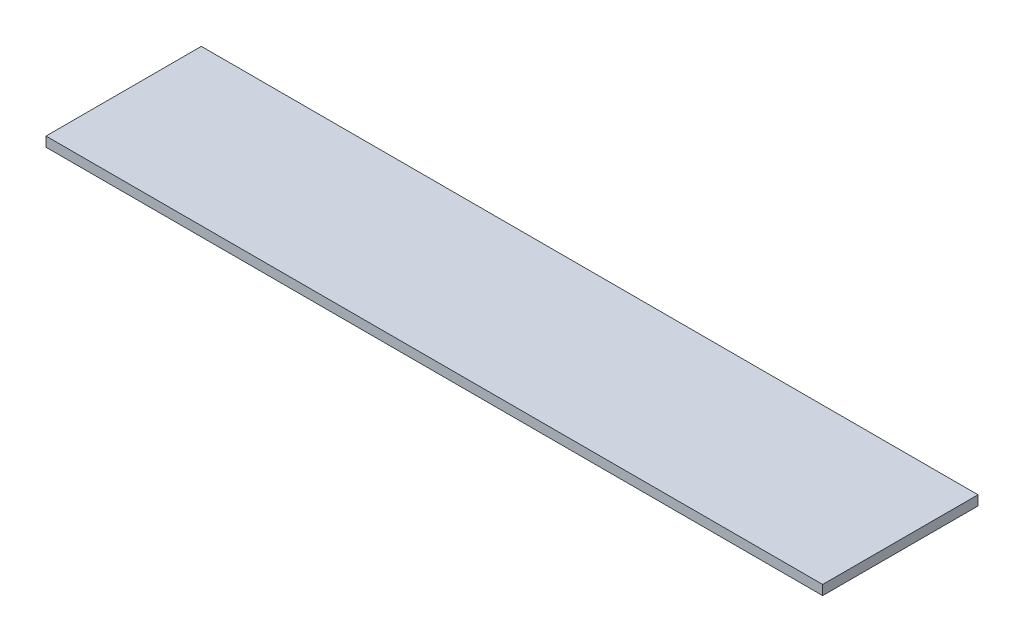
ISO-10303-21;
HEADER;
FILE_DESCRIPTION(('STEP AP214'),'2;1');
FILE_NAME('part.step','',(''),(''),'','','');
FILE_SCHEMA(('AUTOMOTIVE_DESIGN { 1 0 10303 214 1 1 1 1 }'));
ENDSEC;
DATA;
#1=APPLICATION_CONTEXT('core data for automotive mechanical design processes');
#2=APPLICATION_PROTOCOL_DEFINITION('international standard','automotive_design',2000,#1);
#3=PRODUCT_CONTEXT('',#1,'mechanical');
#4=PRODUCT('Part','Part','',(#3));
#5=PRODUCT_RELATED_PRODUCT_CATEGORY('part','',(#4));
#6=PRODUCT_DEFINITION_FORMATION('','',#4);
#7=PRODUCT_DEFINITION_CONTEXT('part definition',#1,'design');
#8=PRODUCT_DEFINITION('design','',#6,#7);
#9=PRODUCT_DEFINITION_SHAPE('','',#8);
#10=(LENGTH_UNIT() NAMED_UNIT(*) SI_UNIT(.MILLI.,.METRE.));
#11=(NAMED_UNIT(*) PLANE_ANGLE_UNIT() SI_UNIT($,.RADIAN.));
#12=(NAMED_UNIT(*) SI_UNIT($,.STERADIAN.) SOLID_ANGLE_UNIT());
#13=UNCERTAINTY_MEASURE_WITH_UNIT(LENGTH_MEASURE(1.E-05),#10,'distance_accuracy_value','');
#14=(GEOMETRIC_REPRESENTATION_CONTEXT(3) GLOBAL_UNCERTAINTY_ASSIGNED_CONTEXT((#13)) GLOBAL_UNIT_ASSIGNED_CONTEXT((#10,
#11,#12)) REPRESENTATION_CONTEXT('',''));
#15=CARTESIAN_POINT('',(0.,0.,0.));
#16=DIRECTION('',(0.,0.,1.));
#17=DIRECTION('',(1.,0.,0.));
#18=AXIS2_PLACEMENT_3D('',#15,#16,#17);
#19=CARTESIAN_POINT('',(0.,1.5875,0.));
#20=DIRECTION('',(1.,0.,0.));
#21=DIRECTION('',(0.,0.,-1.));
#22=AXIS2_PLACEMENT_3D('',#19,#20,#21);
#23=PLANE('',#22);
#24=DIRECTION('',(0.,0.,1.));
#25=VECTOR('',#24,1.);
#26=CARTESIAN_POINT('',(0.,0.,0.));
#27=LINE('',#26,#25);
#28=CARTESIAN_POINT('',(0.,0.,-25.4));
#29=VERTEX_POINT('',#28);
#30=CARTESIAN_POINT('',(0.,0.,0.));
#31=VERTEX_POINT('',#30);
#32=EDGE_CURVE('E96',#29,#31,#27,.T.);
#33=ORIENTED_EDGE('',*,*,#32,.T.);
#34=DIRECTION('',(0.,-1.,0.));
#35=VECTOR('',#34,1.);
#36=CARTESIAN_POINT('',(0.,1.5875,0.));
#37=LINE('',#36,#35);
#38=CARTESIAN_POINT('',(0.,1.5875,0.));
#39=VERTEX_POINT('',#38);
#40=EDGE_CURVE('E11',#39,#31,#37,.T.);
#41=ORIENTED_EDGE('',*,*,#40,.F.);
#42=DIRECTION('',(0.,0.,1.));
#43=VECTOR('',#42,1.);
#44=CARTESIAN_POINT('',(0.,1.5875,0.));
#45=LINE('',#44,#43);
#46=CARTESIAN_POINT('',(0.,1.5875,-25.4));
#47=VERTEX_POINT('',#46);
#48=EDGE_CURVE('E84',#47,#39,#45,.T.);
#49=ORIENTED_EDGE('',*,*,#48,.F.);
#50=DIRECTION('',(0.,-1.,0.));
#51=VECTOR('',#50,1.);
#52=CARTESIAN_POINT('',(0.,1.5875,-25.4));
#53=LINE('',#52,#51);
#54=EDGE_CURVE('E92',#47,#29,#53,.T.);
#55=ORIENTED_EDGE('',*,*,#54,.T.);
#56=EDGE_LOOP('',(#33,#41,#49,#55));
#57=FACE_BOUND('',#56,.T.);
#58=ADVANCED_FACE('F33',(#57),#23,.F.);
#59=CARTESIAN_POINT('',(0.,1.5875,0.));
#60=DIRECTION('',(0.,0.,-1.));
#61=DIRECTION('',(-1.,0.,0.));
#62=AXIS2_PLACEMENT_3D('',#59,#60,#61);
#63=PLANE('',#62);
#64=DIRECTION('',(1.,0.,0.));
#65=VECTOR('',#64,1.);
#66=CARTESIAN_POINT('',(0.,0.,0.));
#67=LINE('',#66,#65);
#68=CARTESIAN_POINT('',(127.,0.,0.));
#69=VERTEX_POINT('',#68);
#70=EDGE_CURVE('E88',#31,#69,#67,.T.);
#71=ORIENTED_EDGE('',*,*,#70,.T.);
#72=DIRECTION('',(0.,-1.,0.));
#73=VECTOR('',#72,1.);
#74=CARTESIAN_POINT('',(127.,1.5875,0.));
#75=LINE('',#74,#73);
#76=CARTESIAN_POINT('',(127.,1.5875,0.));
#77=VERTEX_POINT('',#76);
#78=EDGE_CURVE('E41',#77,#69,#75,.T.);
#79=ORIENTED_EDGE('',*,*,#78,.F.);
#80=DIRECTION('',(1.,0.,0.));
#81=VECTOR('',#80,1.);
#82=CARTESIAN_POINT('',(0.,1.5875,0.));
#83=LINE('',#82,#81);
#84=EDGE_CURVE('E79',#39,#77,#83,.T.);
#85=ORIENTED_EDGE('',*,*,#84,.F.);
#86=ORIENTED_EDGE('',*,*,#40,.T.);
#87=EDGE_LOOP('',(#71,#79,#85,#86));
#88=FACE_BOUND('',#87,.T.);
#89=ADVANCED_FACE('F87',(#88),#63,.F.);
#90=CARTESIAN_POINT('',(127.,1.5875,0.));
#91=DIRECTION('',(-1.,0.,0.));
#92=DIRECTION('',(0.,0.,1.));
#93=AXIS2_PLACEMENT_3D('',#90,#91,#92);
#94=PLANE('',#93);
#95=DIRECTION('',(0.,0.,-1.));
#96=VECTOR('',#95,1.);
#97=CARTESIAN_POINT('',(127.,0.,0.));
#98=LINE('',#97,#96);
#99=CARTESIAN_POINT('',(127.,0.,-25.4));
#100=VERTEX_POINT('',#99);
#101=EDGE_CURVE('E66',#69,#100,#98,.T.);
#102=ORIENTED_EDGE('',*,*,#101,.T.);
#103=DIRECTION('',(0.,-1.,0.));
#104=VECTOR('',#103,1.);
#105=CARTESIAN_POINT('',(127.,1.5875,-25.4));
#106=LINE('',#105,#104);
#107=CARTESIAN_POINT('',(127.,1.5875,-25.4));
#108=VERTEX_POINT('',#107);
#109=EDGE_CURVE('E89',#108,#100,#106,.T.);
#110=ORIENTED_EDGE('',*,*,#109,.F.);
#111=DIRECTION('',(0.,0.,-1.));
#112=VECTOR('',#111,1.);
#113=CARTESIAN_POINT('',(127.,1.5875,0.));
#114=LINE('',#113,#112);
#115=EDGE_CURVE('E82',#77,#108,#114,.T.);
#116=ORIENTED_EDGE('',*,*,#115,.F.);
#117=ORIENTED_EDGE('',*,*,#78,.T.);
#118=EDGE_LOOP('',(#102,#110,#116,#117));
#119=FACE_BOUND('',#118,.T.);
#120=ADVANCED_FACE('F90',(#119),#94,.F.);
#121=CARTESIAN_POINT('',(0.,1.5875,-25.4));
#122=DIRECTION('',(0.,0.,1.));
#123=DIRECTION('',(1.,0.,0.));
#124=AXIS2_PLACEMENT_3D('',#121,#122,#123);
#125=PLANE('',#124);
#126=DIRECTION('',(-1.,0.,0.));
#127=VECTOR('',#126,1.);
#128=CARTESIAN_POINT('',(0.,0.,-25.4));
#129=LINE('',#128,#127);
#130=EDGE_CURVE('E72',#100,#29,#129,.T.);
#131=ORIENTED_EDGE('',*,*,#130,.T.);
#132=ORIENTED_EDGE('',*,*,#54,.F.);
#133=DIRECTION('',(-1.,0.,0.));
#134=VECTOR('',#133,1.);
#135=CARTESIAN_POINT('',(0.,1.5875,-25.4));
#136=LINE('',#135,#134);
#137=EDGE_CURVE('E49',#108,#47,#136,.T.);
#138=ORIENTED_EDGE('',*,*,#137,.F.);
#139=ORIENTED_EDGE('',*,*,#109,.T.);
#140=EDGE_LOOP('',(#131,#132,#138,#139));
#141=FACE_BOUND('',#140,.T.);
#142=ADVANCED_FACE('F103',(#141),#125,.F.);
#143=CARTESIAN_POINT('',(0.,1.5875,0.));
#144=DIRECTION('',(0.,-1.,0.));
#145=DIRECTION('',(0.,0.,-1.));
#146=AXIS2_PLACEMENT_3D('',#143,#144,#145);
#147=PLANE('',#146);
#148=ORIENTED_EDGE('',*,*,#48,.T.);
#149=ORIENTED_EDGE('',*,*,#84,.T.);
#150=ORIENTED_EDGE('',*,*,#115,.T.);
#151=ORIENTED_EDGE('',*,*,#137,.T.);
#152=EDGE_LOOP('',(#148,#149,#150,#151));
#153=FACE_BOUND('',#152,.T.);
#154=ADVANCED_FACE('F80',(#153),#147,.F.);
#155=CARTESIAN_POINT('',(0.,0.,0.));
#156=DIRECTION('',(0.,-1.,0.));
#157=DIRECTION('',(0.,0.,-1.));
#158=AXIS2_PLACEMENT_3D('',#155,#156,#157);
#159=PLANE('',#158);
#160=ORIENTED_EDGE('',*,*,#32,.F.);
#161=ORIENTED_EDGE('',*,*,#130,.F.);
#162=ORIENTED_EDGE('',*,*,#101,.F.);
#163=ORIENTED_EDGE('',*,*,#70,.F.);
#164=EDGE_LOOP('',(#160,#161,#162,#163));
#165=FACE_BOUND('',#164,.T.);
#166=ADVANCED_FACE('F106',(#165),#159,.T.);
#167=CLOSED_SHELL('',(#58,#89,#120,#142,#154,#166));
#168=MANIFOLD_SOLID_BREP('B2',#167);
#169=ADVANCED_BREP_SHAPE_REPRESENTATION('',(#18,#168),#14);
#170=SHAPE_DEFINITION_REPRESENTATION(#9,#169);
ENDSEC;
END-ISO-10303-21;
